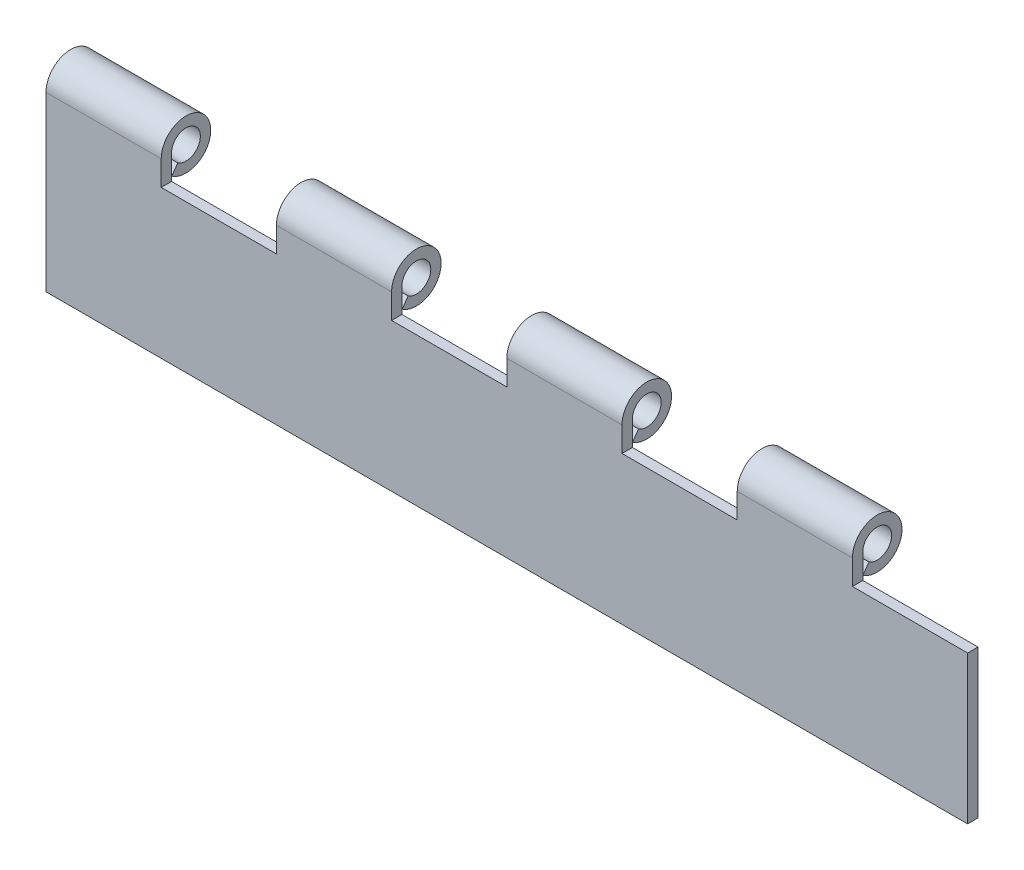
ISO-10303-21;
HEADER;
FILE_DESCRIPTION(('STEP AP214'),'2;1');
FILE_NAME('part.step','',(''),(''),'','','');
FILE_SCHEMA(('AUTOMOTIVE_DESIGN { 1 0 10303 214 1 1 1 1 }'));
ENDSEC;
DATA;
#1=APPLICATION_CONTEXT('core data for automotive mechanical design processes');
#2=APPLICATION_PROTOCOL_DEFINITION('international standard','automotive_design',2000,#1);
#3=PRODUCT_CONTEXT('',#1,'mechanical');
#4=PRODUCT('Part','Part','',(#3));
#5=PRODUCT_RELATED_PRODUCT_CATEGORY('part','',(#4));
#6=PRODUCT_DEFINITION_FORMATION('','',#4);
#7=PRODUCT_DEFINITION_CONTEXT('part definition',#1,'design');
#8=PRODUCT_DEFINITION('design','',#6,#7);
#9=PRODUCT_DEFINITION_SHAPE('','',#8);
#10=(LENGTH_UNIT() NAMED_UNIT(*) SI_UNIT(.MILLI.,.METRE.));
#11=(NAMED_UNIT(*) PLANE_ANGLE_UNIT() SI_UNIT($,.RADIAN.));
#12=(NAMED_UNIT(*) SI_UNIT($,.STERADIAN.) SOLID_ANGLE_UNIT());
#13=UNCERTAINTY_MEASURE_WITH_UNIT(LENGTH_MEASURE(1.E-05),#10,'distance_accuracy_value','');
#14=(GEOMETRIC_REPRESENTATION_CONTEXT(3) GLOBAL_UNCERTAINTY_ASSIGNED_CONTEXT((#13)) GLOBAL_UNIT_ASSIGNED_CONTEXT((#10,
#11,#12)) REPRESENTATION_CONTEXT('',''));
#15=CARTESIAN_POINT('',(0.,0.,0.));
#16=DIRECTION('',(0.,0.,1.));
#17=DIRECTION('',(1.,0.,0.));
#18=AXIS2_PLACEMENT_3D('',#15,#16,#17);
#19=CARTESIAN_POINT('',(-101.6,0.,-5.461));
#20=DIRECTION('',(1.,0.,0.));
#21=DIRECTION('',(0.,0.,-1.));
#22=AXIS2_PLACEMENT_3D('',#19,#20,#21);
#23=CYLINDRICAL_SURFACE('',#22,3.175);
#24=CARTESIAN_POINT('',(-101.6,0.,-5.461));
#25=DIRECTION('',(1.,0.,0.));
#26=DIRECTION('',(0.,0.,-1.));
#27=AXIS2_PLACEMENT_3D('',#24,#25,#26);
#28=CIRCLE('',#27,3.175);
#29=CARTESIAN_POINT('',(-101.6,0.,-2.286));
#30=VERTEX_POINT('',#29);
#31=CARTESIAN_POINT('',(-101.6,-2.60080774061703,-3.63989481458488));
#32=VERTEX_POINT('',#31);
#33=EDGE_CURVE('E267',#30,#32,#28,.F.);
#34=ORIENTED_EDGE('',*,*,#33,.T.);
#35=DIRECTION('',(1.,0.,0.));
#36=VECTOR('',#35,1.);
#37=CARTESIAN_POINT('',(-101.6,-2.60080774061694,-3.63989481458494));
#38=LINE('',#37,#36);
#39=CARTESIAN_POINT('',(-76.2,-2.60080774061703,-3.63989481458488));
#40=VERTEX_POINT('',#39);
#41=EDGE_CURVE('E144',#40,#32,#38,.F.);
#42=ORIENTED_EDGE('',*,*,#41,.F.);
#43=CARTESIAN_POINT('',(-76.2,0.,-5.461));
#44=DIRECTION('',(1.,0.,0.));
#45=DIRECTION('',(0.,0.,-1.));
#46=AXIS2_PLACEMENT_3D('',#43,#44,#45);
#47=CIRCLE('',#46,3.175);
#48=CARTESIAN_POINT('',(-76.2,0.,-2.286));
#49=VERTEX_POINT('',#48);
#50=EDGE_CURVE('E20',#40,#49,#47,.T.);
#51=ORIENTED_EDGE('',*,*,#50,.T.);
#52=DIRECTION('',(-1.,0.,0.));
#53=VECTOR('',#52,1.);
#54=CARTESIAN_POINT('',(-101.6,0.,-2.286));
#55=LINE('',#54,#53);
#56=EDGE_CURVE('E225',#30,#49,#55,.F.);
#57=ORIENTED_EDGE('',*,*,#56,.F.);
#58=EDGE_LOOP('',(#34,#42,#51,#57));
#59=FACE_BOUND('',#58,.T.);
#60=ADVANCED_FACE('F17',(#59),#23,.F.);
#61=CARTESIAN_POINT('',(-101.6,-2.60080774061694,-3.63989481458494));
#62=DIRECTION('',(0.,0.573576436351011,0.819152044289016));
#63=DIRECTION('',(0.,-0.819152044289016,0.573576436351011));
#64=AXIS2_PLACEMENT_3D('',#61,#62,#63);
#65=PLANE('',#64);
#66=DIRECTION('',(1.,0.,0.));
#67=VECTOR('',#66,1.);
#68=CARTESIAN_POINT('',(-101.6,-4.47338931386185,-2.32869908108645));
#69=LINE('',#68,#67);
#70=CARTESIAN_POINT('',(-76.2,-4.47338931386185,-2.32869908108645));
#71=VERTEX_POINT('',#70);
#72=CARTESIAN_POINT('',(-101.6,-4.47338931386185,-2.32869908108645));
#73=VERTEX_POINT('',#72);
#74=EDGE_CURVE('E271',#71,#73,#69,.F.);
#75=ORIENTED_EDGE('',*,*,#74,.F.);
#76=DIRECTION('',(0.,0.819152044289032,-0.573576436350989));
#77=VECTOR('',#76,1.);
#78=CARTESIAN_POINT('',(-76.2,-4.47338931386134,-2.32869908108681));
#79=LINE('',#78,#77);
#80=EDGE_CURVE('E279',#71,#40,#79,.T.);
#81=ORIENTED_EDGE('',*,*,#80,.T.);
#82=ORIENTED_EDGE('',*,*,#41,.T.);
#83=DIRECTION('',(0.,-0.819152044289032,0.573576436350989));
#84=VECTOR('',#83,1.);
#85=CARTESIAN_POINT('',(-101.6,-2.60080774061694,-3.63989481458494));
#86=LINE('',#85,#84);
#87=EDGE_CURVE('E266',#32,#73,#86,.T.);
#88=ORIENTED_EDGE('',*,*,#87,.T.);
#89=EDGE_LOOP('',(#75,#81,#82,#88));
#90=FACE_BOUND('',#89,.T.);
#91=ADVANCED_FACE('F596',(#90),#65,.T.);
#92=CARTESIAN_POINT('',(-101.6,0.,-5.461));
#93=DIRECTION('',(1.,0.,0.));
#94=DIRECTION('',(0.,0.,-1.));
#95=AXIS2_PLACEMENT_3D('',#92,#93,#94);
#96=CYLINDRICAL_SURFACE('',#95,3.175);
#97=CARTESIAN_POINT('',(76.2,0.,-5.461));
#98=DIRECTION('',(1.,0.,0.));
#99=DIRECTION('',(0.,0.,-1.));
#100=AXIS2_PLACEMENT_3D('',#97,#98,#99);
#101=CIRCLE('',#100,3.175);
#102=CARTESIAN_POINT('',(76.2,-2.60080774061703,-3.63989481458488));
#103=VERTEX_POINT('',#102);
#104=CARTESIAN_POINT('',(76.2,0.,-2.286));
#105=VERTEX_POINT('',#104);
#106=EDGE_CURVE('E259',#103,#105,#101,.T.);
#107=ORIENTED_EDGE('',*,*,#106,.T.);
#108=DIRECTION('',(-1.,0.,0.));
#109=VECTOR('',#108,1.);
#110=CARTESIAN_POINT('',(-101.6,0.,-2.286));
#111=LINE('',#110,#109);
#112=CARTESIAN_POINT('',(50.8,0.,-2.286));
#113=VERTEX_POINT('',#112);
#114=EDGE_CURVE('E298',#113,#105,#111,.F.);
#115=ORIENTED_EDGE('',*,*,#114,.F.);
#116=CARTESIAN_POINT('',(50.8,0.,-5.461));
#117=DIRECTION('',(1.,0.,0.));
#118=DIRECTION('',(0.,0.,-1.));
#119=AXIS2_PLACEMENT_3D('',#116,#117,#118);
#120=CIRCLE('',#119,3.175);
#121=CARTESIAN_POINT('',(50.8,-2.60080774061703,-3.63989481458488));
#122=VERTEX_POINT('',#121);
#123=EDGE_CURVE('E252',#113,#122,#120,.F.);
#124=ORIENTED_EDGE('',*,*,#123,.T.);
#125=DIRECTION('',(1.,0.,0.));
#126=VECTOR('',#125,1.);
#127=CARTESIAN_POINT('',(-101.6,-2.60080774061694,-3.63989481458494));
#128=LINE('',#127,#126);
#129=EDGE_CURVE('E283',#103,#122,#128,.F.);
#130=ORIENTED_EDGE('',*,*,#129,.F.);
#131=EDGE_LOOP('',(#107,#115,#124,#130));
#132=FACE_BOUND('',#131,.T.);
#133=ADVANCED_FACE('F586',(#132),#96,.F.);
#134=CARTESIAN_POINT('',(-101.6,-2.60080774061694,-3.63989481458494));
#135=DIRECTION('',(0.,0.573576436351011,0.819152044289016));
#136=DIRECTION('',(0.,-0.819152044289016,0.573576436351011));
#137=AXIS2_PLACEMENT_3D('',#134,#135,#136);
#138=PLANE('',#137);
#139=ORIENTED_EDGE('',*,*,#129,.T.);
#140=DIRECTION('',(0.,-0.819152044289032,0.573576436350989));
#141=VECTOR('',#140,1.);
#142=CARTESIAN_POINT('',(50.8,-2.60080774061694,-3.63989481458494));
#143=LINE('',#142,#141);
#144=CARTESIAN_POINT('',(50.8,-4.47338931386185,-2.32869908108645));
#145=VERTEX_POINT('',#144);
#146=EDGE_CURVE('E251',#122,#145,#143,.T.);
#147=ORIENTED_EDGE('',*,*,#146,.T.);
#148=DIRECTION('',(1.,0.,0.));
#149=VECTOR('',#148,1.);
#150=CARTESIAN_POINT('',(-101.6,-4.47338931386185,-2.32869908108645));
#151=LINE('',#150,#149);
#152=CARTESIAN_POINT('',(76.2,-4.47338931386185,-2.32869908108645));
#153=VERTEX_POINT('',#152);
#154=EDGE_CURVE('E258',#153,#145,#151,.F.);
#155=ORIENTED_EDGE('',*,*,#154,.F.);
#156=DIRECTION('',(0.,0.819152044289032,-0.573576436350989));
#157=VECTOR('',#156,1.);
#158=CARTESIAN_POINT('',(76.2,-4.47338931386134,-2.32869908108681));
#159=LINE('',#158,#157);
#160=EDGE_CURVE('E262',#153,#103,#159,.T.);
#161=ORIENTED_EDGE('',*,*,#160,.T.);
#162=EDGE_LOOP('',(#139,#147,#155,#161));
#163=FACE_BOUND('',#162,.T.);
#164=ADVANCED_FACE('F588',(#163),#138,.T.);
#165=CARTESIAN_POINT('',(-101.6,0.,-5.461));
#166=DIRECTION('',(1.,0.,0.));
#167=DIRECTION('',(0.,0.,-1.));
#168=AXIS2_PLACEMENT_3D('',#165,#166,#167);
#169=CYLINDRICAL_SURFACE('',#168,3.175);
#170=CARTESIAN_POINT('',(25.4,0.,-5.461));
#171=DIRECTION('',(1.,0.,0.));
#172=DIRECTION('',(0.,0.,-1.));
#173=AXIS2_PLACEMENT_3D('',#170,#171,#172);
#174=CIRCLE('',#173,3.175);
#175=CARTESIAN_POINT('',(25.4,-2.60080774061703,-3.63989481458488));
#176=VERTEX_POINT('',#175);
#177=CARTESIAN_POINT('',(25.4,0.,-2.286));
#178=VERTEX_POINT('',#177);
#179=EDGE_CURVE('E244',#176,#178,#174,.T.);
#180=ORIENTED_EDGE('',*,*,#179,.T.);
#181=DIRECTION('',(-1.,0.,0.));
#182=VECTOR('',#181,1.);
#183=CARTESIAN_POINT('',(-101.6,0.,-2.286));
#184=LINE('',#183,#182);
#185=CARTESIAN_POINT('',(0.,0.,-2.286));
#186=VERTEX_POINT('',#185);
#187=EDGE_CURVE('E293',#186,#178,#184,.F.);
#188=ORIENTED_EDGE('',*,*,#187,.F.);
#189=CARTESIAN_POINT('',(0.,0.,-5.461));
#190=DIRECTION('',(1.,0.,0.));
#191=DIRECTION('',(0.,0.,-1.));
#192=AXIS2_PLACEMENT_3D('',#189,#190,#191);
#193=CIRCLE('',#192,3.175);
#194=CARTESIAN_POINT('',(0.,-2.60080774061703,-3.63989481458488));
#195=VERTEX_POINT('',#194);
#196=EDGE_CURVE('E237',#186,#195,#193,.F.);
#197=ORIENTED_EDGE('',*,*,#196,.T.);
#198=DIRECTION('',(1.,0.,0.));
#199=VECTOR('',#198,1.);
#200=CARTESIAN_POINT('',(-101.6,-2.60080774061694,-3.63989481458494));
#201=LINE('',#200,#199);
#202=EDGE_CURVE('E287',#176,#195,#201,.F.);
#203=ORIENTED_EDGE('',*,*,#202,.F.);
#204=EDGE_LOOP('',(#180,#188,#197,#203));
#205=FACE_BOUND('',#204,.T.);
#206=ADVANCED_FACE('F536',(#205),#169,.F.);
#207=CARTESIAN_POINT('',(-101.6,-2.60080774061694,-3.63989481458494));
#208=DIRECTION('',(0.,0.573576436351011,0.819152044289016));
#209=DIRECTION('',(0.,-0.819152044289016,0.573576436351011));
#210=AXIS2_PLACEMENT_3D('',#207,#208,#209);
#211=PLANE('',#210);
#212=ORIENTED_EDGE('',*,*,#202,.T.);
#213=DIRECTION('',(0.,-0.819152044289032,0.573576436350989));
#214=VECTOR('',#213,1.);
#215=CARTESIAN_POINT('',(0.,-2.60080774061694,-3.63989481458494));
#216=LINE('',#215,#214);
#217=CARTESIAN_POINT('',(0.,-4.47338931386185,-2.32869908108645));
#218=VERTEX_POINT('',#217);
#219=EDGE_CURVE('E236',#195,#218,#216,.T.);
#220=ORIENTED_EDGE('',*,*,#219,.T.);
#221=DIRECTION('',(1.,0.,0.));
#222=VECTOR('',#221,1.);
#223=CARTESIAN_POINT('',(-101.6,-4.47338931386185,-2.32869908108645));
#224=LINE('',#223,#222);
#225=CARTESIAN_POINT('',(25.4,-4.47338931386185,-2.32869908108645));
#226=VERTEX_POINT('',#225);
#227=EDGE_CURVE('E243',#226,#218,#224,.F.);
#228=ORIENTED_EDGE('',*,*,#227,.F.);
#229=DIRECTION('',(0.,0.819152044289032,-0.573576436350989));
#230=VECTOR('',#229,1.);
#231=CARTESIAN_POINT('',(25.4,-4.47338931386134,-2.32869908108681));
#232=LINE('',#231,#230);
#233=EDGE_CURVE('E247',#226,#176,#232,.T.);
#234=ORIENTED_EDGE('',*,*,#233,.T.);
#235=EDGE_LOOP('',(#212,#220,#228,#234));
#236=FACE_BOUND('',#235,.T.);
#237=ADVANCED_FACE('F573',(#236),#211,.T.);
#238=CARTESIAN_POINT('',(-101.6,-38.1,-2.286));
#239=DIRECTION('',(0.,0.,-1.));
#240=DIRECTION('',(-1.,0.,0.));
#241=AXIS2_PLACEMENT_3D('',#238,#239,#240);
#242=PLANE('',#241);
#243=DIRECTION('',(1.,0.,0.));
#244=VECTOR('',#243,1.);
#245=CARTESIAN_POINT('',(-76.2,-5.461,-2.286));
#246=LINE('',#245,#244);
#247=CARTESIAN_POINT('',(-76.2,-5.461,-2.286));
#248=VERTEX_POINT('',#247);
#249=CARTESIAN_POINT('',(-50.8,-5.461,-2.286));
#250=VERTEX_POINT('',#249);
#251=EDGE_CURVE('E345',#248,#250,#246,.T.);
#252=ORIENTED_EDGE('',*,*,#251,.T.);
#253=DIRECTION('',(0.,1.,0.));
#254=VECTOR('',#253,1.);
#255=CARTESIAN_POINT('',(-50.8,-5.461,-2.286));
#256=LINE('',#255,#254);
#257=CARTESIAN_POINT('',(-50.8,0.,-2.286));
#258=VERTEX_POINT('',#257);
#259=EDGE_CURVE('E216',#250,#258,#256,.T.);
#260=ORIENTED_EDGE('',*,*,#259,.T.);
#261=DIRECTION('',(1.,0.,0.));
#262=VECTOR('',#261,1.);
#263=CARTESIAN_POINT('',(-101.6,0.,-2.286));
#264=LINE('',#263,#262);
#265=CARTESIAN_POINT('',(-25.4,0.,-2.286));
#266=VERTEX_POINT('',#265);
#267=EDGE_CURVE('E355',#258,#266,#264,.T.);
#268=ORIENTED_EDGE('',*,*,#267,.T.);
#269=DIRECTION('',(0.,1.,0.));
#270=VECTOR('',#269,1.);
#271=CARTESIAN_POINT('',(-25.4,5.461,-2.286));
#272=LINE('',#271,#270);
#273=CARTESIAN_POINT('',(-25.4,-5.461,-2.286));
#274=VERTEX_POINT('',#273);
#275=EDGE_CURVE('E482',#266,#274,#272,.F.);
#276=ORIENTED_EDGE('',*,*,#275,.T.);
#277=DIRECTION('',(1.,0.,0.));
#278=VECTOR('',#277,1.);
#279=CARTESIAN_POINT('',(-25.4,-5.461,-2.286));
#280=LINE('',#279,#278);
#281=CARTESIAN_POINT('',(0.,-5.461,-2.286));
#282=VERTEX_POINT('',#281);
#283=EDGE_CURVE('E235',#274,#282,#280,.T.);
#284=ORIENTED_EDGE('',*,*,#283,.T.);
#285=DIRECTION('',(0.,1.,0.));
#286=VECTOR('',#285,1.);
#287=CARTESIAN_POINT('',(0.,-5.461,-2.286));
#288=LINE('',#287,#286);
#289=EDGE_CURVE('E239',#282,#186,#288,.T.);
#290=ORIENTED_EDGE('',*,*,#289,.T.);
#291=ORIENTED_EDGE('',*,*,#187,.T.);
#292=DIRECTION('',(0.,1.,0.));
#293=VECTOR('',#292,1.);
#294=CARTESIAN_POINT('',(25.4,5.461,-2.286));
#295=LINE('',#294,#293);
#296=CARTESIAN_POINT('',(25.4,-5.461,-2.286));
#297=VERTEX_POINT('',#296);
#298=EDGE_CURVE('E369',#178,#297,#295,.F.);
#299=ORIENTED_EDGE('',*,*,#298,.T.);
#300=DIRECTION('',(1.,0.,0.));
#301=VECTOR('',#300,1.);
#302=CARTESIAN_POINT('',(25.4,-5.461,-2.286));
#303=LINE('',#302,#301);
#304=CARTESIAN_POINT('',(50.8,-5.461,-2.286));
#305=VERTEX_POINT('',#304);
#306=EDGE_CURVE('E250',#297,#305,#303,.T.);
#307=ORIENTED_EDGE('',*,*,#306,.T.);
#308=DIRECTION('',(0.,1.,0.));
#309=VECTOR('',#308,1.);
#310=CARTESIAN_POINT('',(50.8,-5.461,-2.286));
#311=LINE('',#310,#309);
#312=EDGE_CURVE('E254',#305,#113,#311,.T.);
#313=ORIENTED_EDGE('',*,*,#312,.T.);
#314=ORIENTED_EDGE('',*,*,#114,.T.);
#315=DIRECTION('',(0.,1.,0.));
#316=VECTOR('',#315,1.);
#317=CARTESIAN_POINT('',(76.2,5.461,-2.286));
#318=LINE('',#317,#316);
#319=CARTESIAN_POINT('',(76.2,-5.461,-2.286));
#320=VERTEX_POINT('',#319);
#321=EDGE_CURVE('E303',#105,#320,#318,.F.);
#322=ORIENTED_EDGE('',*,*,#321,.T.);
#323=DIRECTION('',(1.,0.,0.));
#324=VECTOR('',#323,1.);
#325=CARTESIAN_POINT('',(76.2,-5.461,-2.286));
#326=LINE('',#325,#324);
#327=CARTESIAN_POINT('',(101.6,-5.461,-2.286));
#328=VERTEX_POINT('',#327);
#329=EDGE_CURVE('E300',#320,#328,#326,.T.);
#330=ORIENTED_EDGE('',*,*,#329,.T.);
#331=DIRECTION('',(0.,1.,0.));
#332=VECTOR('',#331,1.);
#333=CARTESIAN_POINT('',(101.6,0.,-2.286));
#334=LINE('',#333,#332);
#335=CARTESIAN_POINT('',(101.6,-38.1,-2.286));
#336=VERTEX_POINT('',#335);
#337=EDGE_CURVE('E307',#336,#328,#334,.T.);
#338=ORIENTED_EDGE('',*,*,#337,.F.);
#339=DIRECTION('',(1.,0.,0.));
#340=VECTOR('',#339,1.);
#341=CARTESIAN_POINT('',(-101.6,-38.1,-2.286));
#342=LINE('',#341,#340);
#343=CARTESIAN_POINT('',(-101.6,-38.1,-2.286));
#344=VERTEX_POINT('',#343);
#345=EDGE_CURVE('E265',#344,#336,#342,.T.);
#346=ORIENTED_EDGE('',*,*,#345,.F.);
#347=DIRECTION('',(0.,1.,0.));
#348=VECTOR('',#347,1.);
#349=CARTESIAN_POINT('',(-101.6,0.,-2.286));
#350=LINE('',#349,#348);
#351=EDGE_CURVE('E268',#344,#30,#350,.T.);
#352=ORIENTED_EDGE('',*,*,#351,.T.);
#353=ORIENTED_EDGE('',*,*,#56,.T.);
#354=DIRECTION('',(0.,1.,0.));
#355=VECTOR('',#354,1.);
#356=CARTESIAN_POINT('',(-76.2,5.461,-2.286));
#357=LINE('',#356,#355);
#358=EDGE_CURVE('E151',#49,#248,#357,.F.);
#359=ORIENTED_EDGE('',*,*,#358,.T.);
#360=EDGE_LOOP('',(#252,#260,#268,#276,#284,#290,#291,#299,#307,#313,#314,#322,#330,#338,#346,
#352,#353,#359));
#361=FACE_BOUND('',#360,.T.);
#362=ADVANCED_FACE('F512',(#361),#242,.T.);
#363=CARTESIAN_POINT('',(-101.6,0.,-5.461));
#364=DIRECTION('',(1.,0.,0.));
#365=DIRECTION('',(0.,0.,-1.));
#366=AXIS2_PLACEMENT_3D('',#363,#364,#365);
#367=CYLINDRICAL_SURFACE('',#366,3.175);
#368=CARTESIAN_POINT('',(-25.4,0.,-5.461));
#369=DIRECTION('',(1.,0.,0.));
#370=DIRECTION('',(0.,0.,-1.));
#371=AXIS2_PLACEMENT_3D('',#368,#369,#370);
#372=CIRCLE('',#371,3.175);
#373=CARTESIAN_POINT('',(-25.4,-2.60080774061703,-3.63989481458488));
#374=VERTEX_POINT('',#373);
#375=EDGE_CURVE('E229',#374,#266,#372,.T.);
#376=ORIENTED_EDGE('',*,*,#375,.T.);
#377=ORIENTED_EDGE('',*,*,#267,.F.);
#378=CARTESIAN_POINT('',(-50.8,0.,-5.461));
#379=DIRECTION('',(1.,0.,0.));
#380=DIRECTION('',(0.,0.,-1.));
#381=AXIS2_PLACEMENT_3D('',#378,#379,#380);
#382=CIRCLE('',#381,3.175);
#383=CARTESIAN_POINT('',(-50.8,-2.60080774061703,-3.63989481458488));
#384=VERTEX_POINT('',#383);
#385=EDGE_CURVE('E212',#258,#384,#382,.F.);
#386=ORIENTED_EDGE('',*,*,#385,.T.);
#387=DIRECTION('',(1.,0.,0.));
#388=VECTOR('',#387,1.);
#389=CARTESIAN_POINT('',(-101.6,-2.60080774061694,-3.63989481458494));
#390=LINE('',#389,#388);
#391=EDGE_CURVE('E209',#374,#384,#390,.F.);
#392=ORIENTED_EDGE('',*,*,#391,.F.);
#393=EDGE_LOOP('',(#376,#377,#386,#392));
#394=FACE_BOUND('',#393,.T.);
#395=ADVANCED_FACE('F514',(#394),#367,.F.);
#396=CARTESIAN_POINT('',(-101.6,-2.60080774061694,-3.63989481458494));
#397=DIRECTION('',(0.,0.573576436351011,0.819152044289016));
#398=DIRECTION('',(0.,-0.819152044289016,0.573576436351011));
#399=AXIS2_PLACEMENT_3D('',#396,#397,#398);
#400=PLANE('',#399);
#401=ORIENTED_EDGE('',*,*,#391,.T.);
#402=DIRECTION('',(0.,-0.819152044289032,0.573576436350989));
#403=VECTOR('',#402,1.);
#404=CARTESIAN_POINT('',(-50.8,-2.60080774061694,-3.63989481458494));
#405=LINE('',#404,#403);
#406=CARTESIAN_POINT('',(-50.8,-4.47338931386185,-2.32869908108645));
#407=VERTEX_POINT('',#406);
#408=EDGE_CURVE('E204',#384,#407,#405,.T.);
#409=ORIENTED_EDGE('',*,*,#408,.T.);
#410=DIRECTION('',(1.,0.,0.));
#411=VECTOR('',#410,1.);
#412=CARTESIAN_POINT('',(-101.6,-4.47338931386185,-2.32869908108645));
#413=LINE('',#412,#411);
#414=CARTESIAN_POINT('',(-25.4,-4.47338931386185,-2.32869908108645));
#415=VERTEX_POINT('',#414);
#416=EDGE_CURVE('E207',#415,#407,#413,.F.);
#417=ORIENTED_EDGE('',*,*,#416,.F.);
#418=DIRECTION('',(0.,0.819152044289032,-0.573576436350989));
#419=VECTOR('',#418,1.);
#420=CARTESIAN_POINT('',(-25.4,-4.47338931386134,-2.32869908108681));
#421=LINE('',#420,#419);
#422=EDGE_CURVE('E232',#415,#374,#421,.T.);
#423=ORIENTED_EDGE('',*,*,#422,.T.);
#424=EDGE_LOOP('',(#401,#409,#417,#423));
#425=FACE_BOUND('',#424,.T.);
#426=ADVANCED_FACE('F205',(#425),#400,.T.);
#427=CARTESIAN_POINT('',(-76.2,-5.461,0.));
#428=DIRECTION('',(0.,-1.,0.));
#429=DIRECTION('',(0.,0.,-1.));
#430=AXIS2_PLACEMENT_3D('',#427,#428,#429);
#431=PLANE('',#430);
#432=DIRECTION('',(1.,0.,0.));
#433=VECTOR('',#432,1.);
#434=CARTESIAN_POINT('',(-101.6,-5.461,0.));
#435=LINE('',#434,#433);
#436=CARTESIAN_POINT('',(-50.8,-5.461,0.));
#437=VERTEX_POINT('',#436);
#438=CARTESIAN_POINT('',(-76.2,-5.461,0.));
#439=VERTEX_POINT('',#438);
#440=EDGE_CURVE('E197',#437,#439,#435,.F.);
#441=ORIENTED_EDGE('',*,*,#440,.F.);
#442=DIRECTION('',(0.,0.,-1.));
#443=VECTOR('',#442,1.);
#444=CARTESIAN_POINT('',(-50.8,-5.461,0.));
#445=LINE('',#444,#443);
#446=EDGE_CURVE('E220',#437,#250,#445,.T.);
#447=ORIENTED_EDGE('',*,*,#446,.T.);
#448=ORIENTED_EDGE('',*,*,#251,.F.);
#449=DIRECTION('',(0.,0.,1.));
#450=VECTOR('',#449,1.);
#451=CARTESIAN_POINT('',(-76.2,-5.461,0.));
#452=LINE('',#451,#450);
#453=EDGE_CURVE('E343',#248,#439,#452,.T.);
#454=ORIENTED_EDGE('',*,*,#453,.T.);
#455=EDGE_LOOP('',(#441,#447,#448,#454));
#456=FACE_BOUND('',#455,.T.);
#457=ADVANCED_FACE('F662',(#456),#431,.F.);
#458=CARTESIAN_POINT('',(-76.2,5.461,0.));
#459=DIRECTION('',(-1.,0.,0.));
#460=DIRECTION('',(0.,0.,1.));
#461=AXIS2_PLACEMENT_3D('',#458,#459,#460);
#462=PLANE('',#461);
#463=ORIENTED_EDGE('',*,*,#80,.F.);
#464=CARTESIAN_POINT('',(-76.2,0.,-5.461));
#465=DIRECTION('',(1.,0.,0.));
#466=DIRECTION('',(0.,0.,-1.));
#467=AXIS2_PLACEMENT_3D('',#464,#465,#466);
#468=CIRCLE('',#467,5.461);
#469=CARTESIAN_POINT('',(-76.2,0.,0.));
#470=VERTEX_POINT('',#469);
#471=EDGE_CURVE('E269',#470,#71,#468,.F.);
#472=ORIENTED_EDGE('',*,*,#471,.F.);
#473=DIRECTION('',(0.,1.,0.));
#474=VECTOR('',#473,1.);
#475=CARTESIAN_POINT('',(-76.2,0.,0.));
#476=LINE('',#475,#474);
#477=EDGE_CURVE('E337',#439,#470,#476,.T.);
#478=ORIENTED_EDGE('',*,*,#477,.F.);
#479=ORIENTED_EDGE('',*,*,#453,.F.);
#480=ORIENTED_EDGE('',*,*,#358,.F.);
#481=ORIENTED_EDGE('',*,*,#50,.F.);
#482=EDGE_LOOP('',(#463,#472,#478,#479,#480,#481));
#483=FACE_BOUND('',#482,.T.);
#484=ADVANCED_FACE('F578',(#483),#462,.F.);
#485=CARTESIAN_POINT('',(-101.6,0.,-5.461));
#486=DIRECTION('',(1.,0.,0.));
#487=DIRECTION('',(0.,0.,-1.));
#488=AXIS2_PLACEMENT_3D('',#485,#486,#487);
#489=CYLINDRICAL_SURFACE('',#488,5.461);
#490=DIRECTION('',(1.,0.,0.));
#491=VECTOR('',#490,1.);
#492=CARTESIAN_POINT('',(-101.6,0.,0.));
#493=LINE('',#492,#491);
#494=CARTESIAN_POINT('',(-101.6,0.,0.));
#495=VERTEX_POINT('',#494);
#496=EDGE_CURVE('E329',#470,#495,#493,.F.);
#497=ORIENTED_EDGE('',*,*,#496,.F.);
#498=ORIENTED_EDGE('',*,*,#471,.T.);
#499=ORIENTED_EDGE('',*,*,#74,.T.);
#500=CARTESIAN_POINT('',(-101.6,0.,-5.461));
#501=DIRECTION('',(1.,0.,0.));
#502=DIRECTION('',(0.,0.,-1.));
#503=AXIS2_PLACEMENT_3D('',#500,#501,#502);
#504=CIRCLE('',#503,5.461);
#505=EDGE_CURVE('E263',#73,#495,#504,.T.);
#506=ORIENTED_EDGE('',*,*,#505,.T.);
#507=EDGE_LOOP('',(#497,#498,#499,#506));
#508=FACE_BOUND('',#507,.T.);
#509=ADVANCED_FACE('F580',(#508),#489,.T.);
#510=CARTESIAN_POINT('',(-101.6,0.,0.));
#511=DIRECTION('',(1.,0.,0.));
#512=DIRECTION('',(0.,0.,-1.));
#513=AXIS2_PLACEMENT_3D('',#510,#511,#512);
#514=PLANE('',#513);
#515=ORIENTED_EDGE('',*,*,#505,.F.);
#516=ORIENTED_EDGE('',*,*,#87,.F.);
#517=ORIENTED_EDGE('',*,*,#33,.F.);
#518=ORIENTED_EDGE('',*,*,#351,.F.);
#519=DIRECTION('',(0.,0.,-1.));
#520=VECTOR('',#519,1.);
#521=CARTESIAN_POINT('',(-101.6,-38.1,0.));
#522=LINE('',#521,#520);
#523=CARTESIAN_POINT('',(-101.6,-38.1,0.));
#524=VERTEX_POINT('',#523);
#525=EDGE_CURVE('E311',#524,#344,#522,.T.);
#526=ORIENTED_EDGE('',*,*,#525,.F.);
#527=DIRECTION('',(0.,1.,0.));
#528=VECTOR('',#527,1.);
#529=CARTESIAN_POINT('',(-101.6,0.,0.));
#530=LINE('',#529,#528);
#531=EDGE_CURVE('E325',#495,#524,#530,.F.);
#532=ORIENTED_EDGE('',*,*,#531,.F.);
#533=EDGE_LOOP('',(#515,#516,#517,#518,#526,#532));
#534=FACE_BOUND('',#533,.T.);
#535=ADVANCED_FACE('F582',(#534),#514,.F.);
#536=CARTESIAN_POINT('',(-101.6,-38.1,0.));
#537=DIRECTION('',(0.,-1.,0.));
#538=DIRECTION('',(0.,0.,-1.));
#539=AXIS2_PLACEMENT_3D('',#536,#537,#538);
#540=PLANE('',#539);
#541=DIRECTION('',(1.,0.,0.));
#542=VECTOR('',#541,1.);
#543=CARTESIAN_POINT('',(-101.6,-38.1,0.));
#544=LINE('',#543,#542);
#545=CARTESIAN_POINT('',(101.6,-38.1,0.));
#546=VERTEX_POINT('',#545);
#547=EDGE_CURVE('E328',#524,#546,#544,.T.);
#548=ORIENTED_EDGE('',*,*,#547,.F.);
#549=ORIENTED_EDGE('',*,*,#525,.T.);
#550=ORIENTED_EDGE('',*,*,#345,.T.);
#551=DIRECTION('',(0.,0.,-1.));
#552=VECTOR('',#551,1.);
#553=CARTESIAN_POINT('',(101.6,-38.1,0.));
#554=LINE('',#553,#552);
#555=EDGE_CURVE('E309',#546,#336,#554,.T.);
#556=ORIENTED_EDGE('',*,*,#555,.F.);
#557=EDGE_LOOP('',(#548,#549,#550,#556));
#558=FACE_BOUND('',#557,.T.);
#559=ADVANCED_FACE('F428',(#558),#540,.T.);
#560=CARTESIAN_POINT('',(101.6,0.,0.));
#561=DIRECTION('',(1.,0.,0.));
#562=DIRECTION('',(0.,0.,-1.));
#563=AXIS2_PLACEMENT_3D('',#560,#561,#562);
#564=PLANE('',#563);
#565=ORIENTED_EDGE('',*,*,#337,.T.);
#566=DIRECTION('',(0.,0.,-1.));
#567=VECTOR('',#566,1.);
#568=CARTESIAN_POINT('',(101.6,-5.461,0.));
#569=LINE('',#568,#567);
#570=CARTESIAN_POINT('',(101.6,-5.461,0.));
#571=VERTEX_POINT('',#570);
#572=EDGE_CURVE('E304',#328,#571,#569,.F.);
#573=ORIENTED_EDGE('',*,*,#572,.T.);
#574=DIRECTION('',(0.,1.,0.));
#575=VECTOR('',#574,1.);
#576=CARTESIAN_POINT('',(101.6,0.,0.));
#577=LINE('',#576,#575);
#578=EDGE_CURVE('E412',#546,#571,#577,.T.);
#579=ORIENTED_EDGE('',*,*,#578,.F.);
#580=ORIENTED_EDGE('',*,*,#555,.T.);
#581=EDGE_LOOP('',(#565,#573,#579,#580));
#582=FACE_BOUND('',#581,.T.);
#583=ADVANCED_FACE('F430',(#582),#564,.T.);
#584=CARTESIAN_POINT('',(76.2,-5.461,0.));
#585=DIRECTION('',(0.,-1.,0.));
#586=DIRECTION('',(0.,0.,-1.));
#587=AXIS2_PLACEMENT_3D('',#584,#585,#586);
#588=PLANE('',#587);
#589=DIRECTION('',(0.,0.,1.));
#590=VECTOR('',#589,1.);
#591=CARTESIAN_POINT('',(76.2,-5.461,0.));
#592=LINE('',#591,#590);
#593=CARTESIAN_POINT('',(76.2,-5.461,0.));
#594=VERTEX_POINT('',#593);
#595=EDGE_CURVE('E403',#320,#594,#592,.T.);
#596=ORIENTED_EDGE('',*,*,#595,.T.);
#597=DIRECTION('',(1.,0.,0.));
#598=VECTOR('',#597,1.);
#599=CARTESIAN_POINT('',(-101.6,-5.461,0.));
#600=LINE('',#599,#598);
#601=EDGE_CURVE('E399',#571,#594,#600,.F.);
#602=ORIENTED_EDGE('',*,*,#601,.F.);
#603=ORIENTED_EDGE('',*,*,#572,.F.);
#604=ORIENTED_EDGE('',*,*,#329,.F.);
#605=EDGE_LOOP('',(#596,#602,#603,#604));
#606=FACE_BOUND('',#605,.T.);
#607=ADVANCED_FACE('F435',(#606),#588,.F.);
#608=CARTESIAN_POINT('',(76.2,5.461,0.));
#609=DIRECTION('',(-1.,0.,0.));
#610=DIRECTION('',(0.,0.,1.));
#611=AXIS2_PLACEMENT_3D('',#608,#609,#610);
#612=PLANE('',#611);
#613=ORIENTED_EDGE('',*,*,#160,.F.);
#614=CARTESIAN_POINT('',(76.2,0.,-5.461));
#615=DIRECTION('',(1.,0.,0.));
#616=DIRECTION('',(0.,0.,-1.));
#617=AXIS2_PLACEMENT_3D('',#614,#615,#616);
#618=CIRCLE('',#617,5.461);
#619=CARTESIAN_POINT('',(76.2,0.,0.));
#620=VERTEX_POINT('',#619);
#621=EDGE_CURVE('E255',#620,#153,#618,.F.);
#622=ORIENTED_EDGE('',*,*,#621,.F.);
#623=DIRECTION('',(0.,1.,0.));
#624=VECTOR('',#623,1.);
#625=CARTESIAN_POINT('',(76.2,0.,0.));
#626=LINE('',#625,#624);
#627=EDGE_CURVE('E396',#594,#620,#626,.T.);
#628=ORIENTED_EDGE('',*,*,#627,.F.);
#629=ORIENTED_EDGE('',*,*,#595,.F.);
#630=ORIENTED_EDGE('',*,*,#321,.F.);
#631=ORIENTED_EDGE('',*,*,#106,.F.);
#632=EDGE_LOOP('',(#613,#622,#628,#629,#630,#631));
#633=FACE_BOUND('',#632,.T.);
#634=ADVANCED_FACE('F440',(#633),#612,.F.);
#635=CARTESIAN_POINT('',(-101.6,0.,-5.461));
#636=DIRECTION('',(1.,0.,0.));
#637=DIRECTION('',(0.,0.,-1.));
#638=AXIS2_PLACEMENT_3D('',#635,#636,#637);
#639=CYLINDRICAL_SURFACE('',#638,5.461);
#640=ORIENTED_EDGE('',*,*,#154,.T.);
#641=CARTESIAN_POINT('',(50.8,0.,-5.461));
#642=DIRECTION('',(1.,0.,0.));
#643=DIRECTION('',(0.,0.,-1.));
#644=AXIS2_PLACEMENT_3D('',#641,#642,#643);
#645=CIRCLE('',#644,5.461);
#646=CARTESIAN_POINT('',(50.8,0.,0.));
#647=VERTEX_POINT('',#646);
#648=EDGE_CURVE('E248',#145,#647,#645,.T.);
#649=ORIENTED_EDGE('',*,*,#648,.T.);
#650=DIRECTION('',(1.,0.,0.));
#651=VECTOR('',#650,1.);
#652=CARTESIAN_POINT('',(-101.6,0.,0.));
#653=LINE('',#652,#651);
#654=EDGE_CURVE('E387',#620,#647,#653,.F.);
#655=ORIENTED_EDGE('',*,*,#654,.F.);
#656=ORIENTED_EDGE('',*,*,#621,.T.);
#657=EDGE_LOOP('',(#640,#649,#655,#656));
#658=FACE_BOUND('',#657,.T.);
#659=ADVANCED_FACE('F446',(#658),#639,.T.);
#660=CARTESIAN_POINT('',(50.8,-5.461,0.));
#661=DIRECTION('',(1.,0.,0.));
#662=DIRECTION('',(0.,0.,-1.));
#663=AXIS2_PLACEMENT_3D('',#660,#661,#662);
#664=PLANE('',#663);
#665=DIRECTION('',(0.,1.,0.));
#666=VECTOR('',#665,1.);
#667=CARTESIAN_POINT('',(50.8,0.,0.));
#668=LINE('',#667,#666);
#669=CARTESIAN_POINT('',(50.8,-5.461,0.));
#670=VERTEX_POINT('',#669);
#671=EDGE_CURVE('E383',#647,#670,#668,.F.);
#672=ORIENTED_EDGE('',*,*,#671,.F.);
#673=ORIENTED_EDGE('',*,*,#648,.F.);
#674=ORIENTED_EDGE('',*,*,#146,.F.);
#675=ORIENTED_EDGE('',*,*,#123,.F.);
#676=ORIENTED_EDGE('',*,*,#312,.F.);
#677=DIRECTION('',(0.,0.,-1.));
#678=VECTOR('',#677,1.);
#679=CARTESIAN_POINT('',(50.8,-5.461,0.));
#680=LINE('',#679,#678);
#681=EDGE_CURVE('E364',#305,#670,#680,.F.);
#682=ORIENTED_EDGE('',*,*,#681,.T.);
#683=EDGE_LOOP('',(#672,#673,#674,#675,#676,#682));
#684=FACE_BOUND('',#683,.T.);
#685=ADVANCED_FACE('F448',(#684),#664,.F.);
#686=CARTESIAN_POINT('',(25.4,-5.461,0.));
#687=DIRECTION('',(0.,-1.,0.));
#688=DIRECTION('',(0.,0.,-1.));
#689=AXIS2_PLACEMENT_3D('',#686,#687,#688);
#690=PLANE('',#689);
#691=DIRECTION('',(1.,0.,0.));
#692=VECTOR('',#691,1.);
#693=CARTESIAN_POINT('',(-101.6,-5.461,0.));
#694=LINE('',#693,#692);
#695=CARTESIAN_POINT('',(25.4,-5.461,0.));
#696=VERTEX_POINT('',#695);
#697=EDGE_CURVE('E386',#670,#696,#694,.F.);
#698=ORIENTED_EDGE('',*,*,#697,.F.);
#699=ORIENTED_EDGE('',*,*,#681,.F.);
#700=ORIENTED_EDGE('',*,*,#306,.F.);
#701=DIRECTION('',(0.,0.,1.));
#702=VECTOR('',#701,1.);
#703=CARTESIAN_POINT('',(25.4,-5.461,0.));
#704=LINE('',#703,#702);
#705=EDGE_CURVE('E375',#297,#696,#704,.T.);
#706=ORIENTED_EDGE('',*,*,#705,.T.);
#707=EDGE_LOOP('',(#698,#699,#700,#706));
#708=FACE_BOUND('',#707,.T.);
#709=ADVANCED_FACE('F540',(#708),#690,.F.);
#710=CARTESIAN_POINT('',(25.4,5.461,0.));
#711=DIRECTION('',(-1.,0.,0.));
#712=DIRECTION('',(0.,0.,1.));
#713=AXIS2_PLACEMENT_3D('',#710,#711,#712);
#714=PLANE('',#713);
#715=ORIENTED_EDGE('',*,*,#233,.F.);
#716=CARTESIAN_POINT('',(25.4,0.,-5.461));
#717=DIRECTION('',(1.,0.,0.));
#718=DIRECTION('',(0.,0.,-1.));
#719=AXIS2_PLACEMENT_3D('',#716,#717,#718);
#720=CIRCLE('',#719,5.461);
#721=CARTESIAN_POINT('',(25.4,0.,0.));
#722=VERTEX_POINT('',#721);
#723=EDGE_CURVE('E240',#722,#226,#720,.F.);
#724=ORIENTED_EDGE('',*,*,#723,.F.);
#725=DIRECTION('',(0.,1.,0.));
#726=VECTOR('',#725,1.);
#727=CARTESIAN_POINT('',(25.4,0.,0.));
#728=LINE('',#727,#726);
#729=EDGE_CURVE('E453',#696,#722,#728,.T.);
#730=ORIENTED_EDGE('',*,*,#729,.F.);
#731=ORIENTED_EDGE('',*,*,#705,.F.);
#732=ORIENTED_EDGE('',*,*,#298,.F.);
#733=ORIENTED_EDGE('',*,*,#179,.F.);
#734=EDGE_LOOP('',(#715,#724,#730,#731,#732,#733));
#735=FACE_BOUND('',#734,.T.);
#736=ADVANCED_FACE('F539',(#735),#714,.F.);
#737=CARTESIAN_POINT('',(-101.6,0.,-5.461));
#738=DIRECTION('',(1.,0.,0.));
#739=DIRECTION('',(0.,0.,-1.));
#740=AXIS2_PLACEMENT_3D('',#737,#738,#739);
#741=CYLINDRICAL_SURFACE('',#740,5.461);
#742=ORIENTED_EDGE('',*,*,#227,.T.);
#743=CARTESIAN_POINT('',(0.,0.,-5.461));
#744=DIRECTION('',(1.,0.,0.));
#745=DIRECTION('',(0.,0.,-1.));
#746=AXIS2_PLACEMENT_3D('',#743,#744,#745);
#747=CIRCLE('',#746,5.461);
#748=CARTESIAN_POINT('',(0.,0.,0.));
#749=VERTEX_POINT('',#748);
#750=EDGE_CURVE('E233',#218,#749,#747,.T.);
#751=ORIENTED_EDGE('',*,*,#750,.T.);
#752=DIRECTION('',(1.,0.,0.));
#753=VECTOR('',#752,1.);
#754=CARTESIAN_POINT('',(-101.6,0.,0.));
#755=LINE('',#754,#753);
#756=EDGE_CURVE('E455',#722,#749,#755,.F.);
#757=ORIENTED_EDGE('',*,*,#756,.F.);
#758=ORIENTED_EDGE('',*,*,#723,.T.);
#759=EDGE_LOOP('',(#742,#751,#757,#758));
#760=FACE_BOUND('',#759,.T.);
#761=ADVANCED_FACE('F548',(#760),#741,.T.);
#762=CARTESIAN_POINT('',(0.,-5.461,0.));
#763=DIRECTION('',(1.,0.,0.));
#764=DIRECTION('',(0.,0.,-1.));
#765=AXIS2_PLACEMENT_3D('',#762,#763,#764);
#766=PLANE('',#765);
#767=DIRECTION('',(0.,1.,0.));
#768=VECTOR('',#767,1.);
#769=CARTESIAN_POINT('',(0.,0.,0.));
#770=LINE('',#769,#768);
#771=CARTESIAN_POINT('',(0.,-5.461,0.));
#772=VERTEX_POINT('',#771);
#773=EDGE_CURVE('E468',#749,#772,#770,.F.);
#774=ORIENTED_EDGE('',*,*,#773,.F.);
#775=ORIENTED_EDGE('',*,*,#750,.F.);
#776=ORIENTED_EDGE('',*,*,#219,.F.);
#777=ORIENTED_EDGE('',*,*,#196,.F.);
#778=ORIENTED_EDGE('',*,*,#289,.F.);
#779=DIRECTION('',(0.,0.,-1.));
#780=VECTOR('',#779,1.);
#781=CARTESIAN_POINT('',(0.,-5.461,0.));
#782=LINE('',#781,#780);
#783=EDGE_CURVE('E358',#282,#772,#782,.F.);
#784=ORIENTED_EDGE('',*,*,#783,.T.);
#785=EDGE_LOOP('',(#774,#775,#776,#777,#778,#784));
#786=FACE_BOUND('',#785,.T.);
#787=ADVANCED_FACE('F529',(#786),#766,.F.);
#788=CARTESIAN_POINT('',(-25.4,-5.461,0.));
#789=DIRECTION('',(0.,-1.,0.));
#790=DIRECTION('',(0.,0.,-1.));
#791=AXIS2_PLACEMENT_3D('',#788,#789,#790);
#792=PLANE('',#791);
#793=DIRECTION('',(1.,0.,0.));
#794=VECTOR('',#793,1.);
#795=CARTESIAN_POINT('',(-101.6,-5.461,0.));
#796=LINE('',#795,#794);
#797=CARTESIAN_POINT('',(-25.4,-5.461,0.));
#798=VERTEX_POINT('',#797);
#799=EDGE_CURVE('E478',#772,#798,#796,.F.);
#800=ORIENTED_EDGE('',*,*,#799,.F.);
#801=ORIENTED_EDGE('',*,*,#783,.F.);
#802=ORIENTED_EDGE('',*,*,#283,.F.);
#803=DIRECTION('',(0.,0.,1.));
#804=VECTOR('',#803,1.);
#805=CARTESIAN_POINT('',(-25.4,-5.461,0.));
#806=LINE('',#805,#804);
#807=EDGE_CURVE('E490',#274,#798,#806,.T.);
#808=ORIENTED_EDGE('',*,*,#807,.T.);
#809=EDGE_LOOP('',(#800,#801,#802,#808));
#810=FACE_BOUND('',#809,.T.);
#811=ADVANCED_FACE('F526',(#810),#792,.F.);
#812=CARTESIAN_POINT('',(-25.4,5.461,0.));
#813=DIRECTION('',(-1.,0.,0.));
#814=DIRECTION('',(0.,0.,1.));
#815=AXIS2_PLACEMENT_3D('',#812,#813,#814);
#816=PLANE('',#815);
#817=ORIENTED_EDGE('',*,*,#422,.F.);
#818=CARTESIAN_POINT('',(-25.4,0.,-5.461));
#819=DIRECTION('',(1.,0.,0.));
#820=DIRECTION('',(0.,0.,-1.));
#821=AXIS2_PLACEMENT_3D('',#818,#819,#820);
#822=CIRCLE('',#821,5.461);
#823=CARTESIAN_POINT('',(-25.4,0.,0.));
#824=VERTEX_POINT('',#823);
#825=EDGE_CURVE('E215',#824,#415,#822,.F.);
#826=ORIENTED_EDGE('',*,*,#825,.F.);
#827=DIRECTION('',(0.,1.,0.));
#828=VECTOR('',#827,1.);
#829=CARTESIAN_POINT('',(-25.4,0.,0.));
#830=LINE('',#829,#828);
#831=EDGE_CURVE('E487',#798,#824,#830,.T.);
#832=ORIENTED_EDGE('',*,*,#831,.F.);
#833=ORIENTED_EDGE('',*,*,#807,.F.);
#834=ORIENTED_EDGE('',*,*,#275,.F.);
#835=ORIENTED_EDGE('',*,*,#375,.F.);
#836=EDGE_LOOP('',(#817,#826,#832,#833,#834,#835));
#837=FACE_BOUND('',#836,.T.);
#838=ADVANCED_FACE('F519',(#837),#816,.F.);
#839=CARTESIAN_POINT('',(-101.6,0.,-5.461));
#840=DIRECTION('',(1.,0.,0.));
#841=DIRECTION('',(0.,0.,-1.));
#842=AXIS2_PLACEMENT_3D('',#839,#840,#841);
#843=CYLINDRICAL_SURFACE('',#842,5.461);
#844=ORIENTED_EDGE('',*,*,#416,.T.);
#845=CARTESIAN_POINT('',(-50.8,0.,-5.461));
#846=DIRECTION('',(1.,0.,0.));
#847=DIRECTION('',(0.,0.,-1.));
#848=AXIS2_PLACEMENT_3D('',#845,#846,#847);
#849=CIRCLE('',#848,5.461);
#850=CARTESIAN_POINT('',(-50.8,0.,0.));
#851=VERTEX_POINT('',#850);
#852=EDGE_CURVE('E35',#407,#851,#849,.T.);
#853=ORIENTED_EDGE('',*,*,#852,.T.);
#854=DIRECTION('',(1.,0.,0.));
#855=VECTOR('',#854,1.);
#856=CARTESIAN_POINT('',(-101.6,0.,0.));
#857=LINE('',#856,#855);
#858=EDGE_CURVE('E26',#824,#851,#857,.F.);
#859=ORIENTED_EDGE('',*,*,#858,.F.);
#860=ORIENTED_EDGE('',*,*,#825,.T.);
#861=EDGE_LOOP('',(#844,#853,#859,#860));
#862=FACE_BOUND('',#861,.T.);
#863=ADVANCED_FACE('F214',(#862),#843,.T.);
#864=CARTESIAN_POINT('',(-50.8,-5.461,0.));
#865=DIRECTION('',(1.,0.,0.));
#866=DIRECTION('',(0.,0.,-1.));
#867=AXIS2_PLACEMENT_3D('',#864,#865,#866);
#868=PLANE('',#867);
#869=DIRECTION('',(0.,1.,0.));
#870=VECTOR('',#869,1.);
#871=CARTESIAN_POINT('',(-50.8,0.,0.));
#872=LINE('',#871,#870);
#873=EDGE_CURVE('E11',#851,#437,#872,.F.);
#874=ORIENTED_EDGE('',*,*,#873,.F.);
#875=ORIENTED_EDGE('',*,*,#852,.F.);
#876=ORIENTED_EDGE('',*,*,#408,.F.);
#877=ORIENTED_EDGE('',*,*,#385,.F.);
#878=ORIENTED_EDGE('',*,*,#259,.F.);
#879=ORIENTED_EDGE('',*,*,#446,.F.);
#880=EDGE_LOOP('',(#874,#875,#876,#877,#878,#879));
#881=FACE_BOUND('',#880,.T.);
#882=ADVANCED_FACE('F218',(#881),#868,.F.);
#883=CARTESIAN_POINT('',(-101.6,0.,0.));
#884=DIRECTION('',(0.,0.,1.));
#885=DIRECTION('',(1.,0.,0.));
#886=AXIS2_PLACEMENT_3D('',#883,#884,#885);
#887=PLANE('',#886);
#888=ORIENTED_EDGE('',*,*,#858,.T.);
#889=ORIENTED_EDGE('',*,*,#873,.T.);
#890=ORIENTED_EDGE('',*,*,#440,.T.);
#891=ORIENTED_EDGE('',*,*,#477,.T.);
#892=ORIENTED_EDGE('',*,*,#496,.T.);
#893=ORIENTED_EDGE('',*,*,#531,.T.);
#894=ORIENTED_EDGE('',*,*,#547,.T.);
#895=ORIENTED_EDGE('',*,*,#578,.T.);
#896=ORIENTED_EDGE('',*,*,#601,.T.);
#897=ORIENTED_EDGE('',*,*,#627,.T.);
#898=ORIENTED_EDGE('',*,*,#654,.T.);
#899=ORIENTED_EDGE('',*,*,#671,.T.);
#900=ORIENTED_EDGE('',*,*,#697,.T.);
#901=ORIENTED_EDGE('',*,*,#729,.T.);
#902=ORIENTED_EDGE('',*,*,#756,.T.);
#903=ORIENTED_EDGE('',*,*,#773,.T.);
#904=ORIENTED_EDGE('',*,*,#799,.T.);
#905=ORIENTED_EDGE('',*,*,#831,.T.);
#906=EDGE_LOOP('',(#888,#889,#890,#891,#892,#893,#894,#895,#896,#897,#898,#899,#900,#901,#902,
#903,#904,#905));
#907=FACE_BOUND('',#906,.T.);
#908=ADVANCED_FACE('F425',(#907),#887,.T.);
#909=CLOSED_SHELL('',(#60,#91,#133,#164,#206,#237,#362,#395,#426,#457,#484,#509,#535,#559,#583,
#607,#634,#659,#685,#709,#736,#761,#787,#811,#838,#863,#882,#908));
#910=MANIFOLD_SOLID_BREP('B1',#909);
#911=ADVANCED_BREP_SHAPE_REPRESENTATION('',(#18,#910),#14);
#912=SHAPE_DEFINITION_REPRESENTATION(#9,#911);
ENDSEC;
END-ISO-10303-21;
